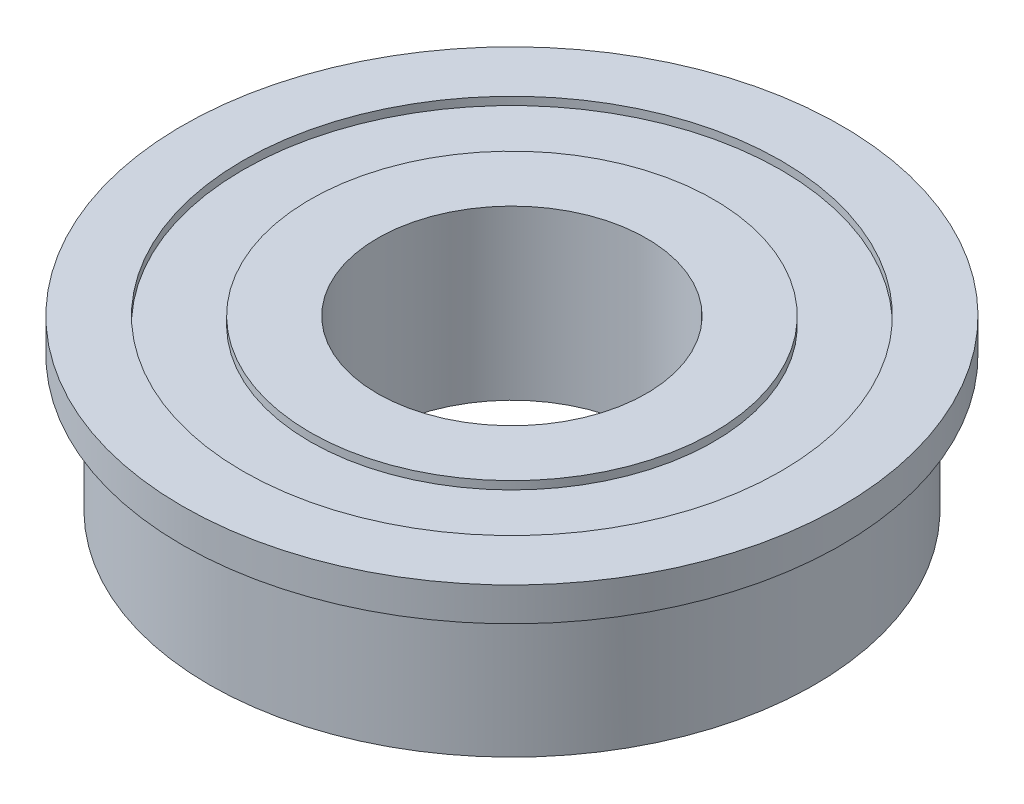
ISO-10303-21;
HEADER;
FILE_DESCRIPTION(('STEP AP214'),'2;1');
FILE_NAME('part.step','',(''),(''),'','','');
FILE_SCHEMA(('AUTOMOTIVE_DESIGN { 1 0 10303 214 1 1 1 1 }'));
ENDSEC;
DATA;
#1=APPLICATION_CONTEXT('core data for automotive mechanical design processes');
#2=APPLICATION_PROTOCOL_DEFINITION('international standard','automotive_design',2000,#1);
#3=PRODUCT_CONTEXT('',#1,'mechanical');
#4=PRODUCT('Part','Part','',(#3));
#5=PRODUCT_RELATED_PRODUCT_CATEGORY('part','',(#4));
#6=PRODUCT_DEFINITION_FORMATION('','',#4);
#7=PRODUCT_DEFINITION_CONTEXT('part definition',#1,'design');
#8=PRODUCT_DEFINITION('design','',#6,#7);
#9=PRODUCT_DEFINITION_SHAPE('','',#8);
#10=(LENGTH_UNIT() NAMED_UNIT(*) SI_UNIT(.MILLI.,.METRE.));
#11=(NAMED_UNIT(*) PLANE_ANGLE_UNIT() SI_UNIT($,.RADIAN.));
#12=(NAMED_UNIT(*) SI_UNIT($,.STERADIAN.) SOLID_ANGLE_UNIT());
#13=UNCERTAINTY_MEASURE_WITH_UNIT(LENGTH_MEASURE(1.E-05),#10,'distance_accuracy_value','');
#14=(GEOMETRIC_REPRESENTATION_CONTEXT(3) GLOBAL_UNCERTAINTY_ASSIGNED_CONTEXT((#13)) GLOBAL_UNIT_ASSIGNED_CONTEXT((#10,
#11,#12)) REPRESENTATION_CONTEXT('',''));
#15=CARTESIAN_POINT('',(0.,0.,0.));
#16=DIRECTION('',(0.,0.,1.));
#17=DIRECTION('',(1.,0.,0.));
#18=AXIS2_PLACEMENT_3D('',#15,#16,#17);
#19=CARTESIAN_POINT('',(12.7,7.9375,0.));
#20=DIRECTION('',(0.,1.,0.));
#21=DIRECTION('',(0.,0.,1.));
#22=AXIS2_PLACEMENT_3D('',#19,#20,#21);
#23=PLANE('',#22);
#24=CARTESIAN_POINT('',(0.,7.9375,0.));
#25=DIRECTION('',(0.,1.,0.));
#26=DIRECTION('',(0.,0.,1.));
#27=AXIS2_PLACEMENT_3D('',#24,#25,#26);
#28=CIRCLE('',#27,12.7);
#29=CARTESIAN_POINT('',(0.,7.9375,12.7));
#30=VERTEX_POINT('',#29);
#31=EDGE_CURVE('E94',#30,#30,#28,.F.);
#32=ORIENTED_EDGE('',*,*,#31,.T.);
#33=EDGE_LOOP('',(#32));
#34=FACE_BOUND('',#33,.T.);
#35=CARTESIAN_POINT('',(0.,7.9375,0.));
#36=DIRECTION('',(0.,1.,0.));
#37=DIRECTION('',(0.,0.,1.));
#38=AXIS2_PLACEMENT_3D('',#35,#36,#37);
#39=CIRCLE('',#38,15.5575);
#40=CARTESIAN_POINT('',(0.,7.9375,15.5575));
#41=VERTEX_POINT('',#40);
#42=EDGE_CURVE('E50',#41,#41,#39,.F.);
#43=ORIENTED_EDGE('',*,*,#42,.F.);
#44=EDGE_LOOP('',(#43));
#45=FACE_BOUND('',#44,.T.);
#46=ADVANCED_FACE('F17',(#34,#45),#23,.T.);
#47=CARTESIAN_POINT('',(0.,0.,0.));
#48=DIRECTION('',(0.,1.,0.));
#49=DIRECTION('',(0.,0.,1.));
#50=AXIS2_PLACEMENT_3D('',#47,#48,#49);
#51=CYLINDRICAL_SURFACE('',#50,15.5575);
#52=CARTESIAN_POINT('',(0.,6.35,0.));
#53=DIRECTION('',(0.,1.,0.));
#54=DIRECTION('',(0.,0.,1.));
#55=AXIS2_PLACEMENT_3D('',#52,#53,#54);
#56=CIRCLE('',#55,15.5575);
#57=CARTESIAN_POINT('',(0.,6.35,15.5575));
#58=VERTEX_POINT('',#57);
#59=EDGE_CURVE('E92',#58,#58,#56,.F.);
#60=ORIENTED_EDGE('',*,*,#59,.F.);
#61=EDGE_LOOP('',(#60));
#62=FACE_BOUND('',#61,.T.);
#63=ORIENTED_EDGE('',*,*,#42,.T.);
#64=EDGE_LOOP('',(#63));
#65=FACE_BOUND('',#64,.T.);
#66=ADVANCED_FACE('F101',(#62,#65),#51,.T.);
#67=CARTESIAN_POINT('',(0.,0.,0.));
#68=DIRECTION('',(0.,1.,0.));
#69=DIRECTION('',(0.,0.,1.));
#70=AXIS2_PLACEMENT_3D('',#67,#68,#69);
#71=CYLINDRICAL_SURFACE('',#70,12.7);
#72=ORIENTED_EDGE('',*,*,#31,.F.);
#73=EDGE_LOOP('',(#72));
#74=FACE_BOUND('',#73,.T.);
#75=CARTESIAN_POINT('',(0.,7.5565,0.));
#76=DIRECTION('',(0.,1.,0.));
#77=DIRECTION('',(0.,0.,1.));
#78=AXIS2_PLACEMENT_3D('',#75,#76,#77);
#79=CIRCLE('',#78,12.7);
#80=CARTESIAN_POINT('',(0.,7.5565,12.7));
#81=VERTEX_POINT('',#80);
#82=EDGE_CURVE('E41',#81,#81,#79,.T.);
#83=ORIENTED_EDGE('',*,*,#82,.F.);
#84=EDGE_LOOP('',(#83));
#85=FACE_BOUND('',#84,.T.);
#86=ADVANCED_FACE('F108',(#74,#85),#71,.F.);
#87=CARTESIAN_POINT('',(15.5575,6.35,0.));
#88=DIRECTION('',(0.,-1.,0.));
#89=DIRECTION('',(0.,0.,-1.));
#90=AXIS2_PLACEMENT_3D('',#87,#88,#89);
#91=PLANE('',#90);
#92=ORIENTED_EDGE('',*,*,#59,.T.);
#93=EDGE_LOOP('',(#92));
#94=FACE_BOUND('',#93,.T.);
#95=CARTESIAN_POINT('',(0.,6.35,0.));
#96=DIRECTION('',(0.,-1.,0.));
#97=DIRECTION('',(0.,0.,-1.));
#98=AXIS2_PLACEMENT_3D('',#95,#96,#97);
#99=CIRCLE('',#98,14.2875);
#100=CARTESIAN_POINT('',(0.,6.35,14.2875));
#101=VERTEX_POINT('',#100);
#102=CARTESIAN_POINT('',(0.,6.35,-14.2875));
#103=VERTEX_POINT('',#102);
#104=EDGE_CURVE('E37',#101,#103,#99,.F.);
#105=ORIENTED_EDGE('',*,*,#104,.T.);
#106=CARTESIAN_POINT('',(0.,6.35,0.));
#107=DIRECTION('',(0.,-1.,0.));
#108=DIRECTION('',(0.,0.,1.));
#109=AXIS2_PLACEMENT_3D('',#106,#107,#108);
#110=CIRCLE('',#109,14.2875);
#111=EDGE_CURVE('E34',#103,#101,#110,.F.);
#112=ORIENTED_EDGE('',*,*,#111,.T.);
#113=EDGE_LOOP('',(#105,#112));
#114=FACE_BOUND('',#113,.T.);
#115=ADVANCED_FACE('F39',(#94,#114),#91,.T.);
#116=CARTESIAN_POINT('',(9.525,7.5565,0.));
#117=DIRECTION('',(0.,1.,0.));
#118=DIRECTION('',(0.,0.,1.));
#119=AXIS2_PLACEMENT_3D('',#116,#117,#118);
#120=PLANE('',#119);
#121=CARTESIAN_POINT('',(0.,7.5565,0.));
#122=DIRECTION('',(0.,1.,0.));
#123=DIRECTION('',(0.,0.,1.));
#124=AXIS2_PLACEMENT_3D('',#121,#122,#123);
#125=CIRCLE('',#124,9.525);
#126=CARTESIAN_POINT('',(0.,7.5565,9.525));
#127=VERTEX_POINT('',#126);
#128=EDGE_CURVE('E47',#127,#127,#125,.T.);
#129=ORIENTED_EDGE('',*,*,#128,.F.);
#130=EDGE_LOOP('',(#129));
#131=FACE_BOUND('',#130,.T.);
#132=ORIENTED_EDGE('',*,*,#82,.T.);
#133=EDGE_LOOP('',(#132));
#134=FACE_BOUND('',#133,.T.);
#135=ADVANCED_FACE('F139',(#131,#134),#120,.T.);
#136=CARTESIAN_POINT('',(0.,0.,0.));
#137=DIRECTION('',(0.,1.,0.));
#138=DIRECTION('',(0.,0.,1.));
#139=AXIS2_PLACEMENT_3D('',#136,#137,#138);
#140=CYLINDRICAL_SURFACE('',#139,9.525);
#141=ORIENTED_EDGE('',*,*,#128,.T.);
#142=EDGE_LOOP('',(#141));
#143=FACE_BOUND('',#142,.T.);
#144=CARTESIAN_POINT('',(0.,7.9375,0.));
#145=DIRECTION('',(0.,1.,0.));
#146=DIRECTION('',(0.,0.,1.));
#147=AXIS2_PLACEMENT_3D('',#144,#145,#146);
#148=CIRCLE('',#147,9.525);
#149=CARTESIAN_POINT('',(0.,7.9375,9.525));
#150=VERTEX_POINT('',#149);
#151=EDGE_CURVE('E74',#150,#150,#148,.T.);
#152=ORIENTED_EDGE('',*,*,#151,.F.);
#153=EDGE_LOOP('',(#152));
#154=FACE_BOUND('',#153,.T.);
#155=ADVANCED_FACE('F64',(#143,#154),#140,.T.);
#156=CARTESIAN_POINT('',(0.,6.1,0.));
#157=DIRECTION('',(0.,1.,0.));
#158=DIRECTION('',(0.,0.,1.));
#159=AXIS2_PLACEMENT_3D('',#156,#157,#158);
#160=TOROIDAL_SURFACE('',#159,14.2875,0.250000000000001);
#161=ORIENTED_EDGE('',*,*,#111,.F.);
#162=ORIENTED_EDGE('',*,*,#104,.F.);
#163=EDGE_LOOP('',(#161,#162));
#164=FACE_BOUND('',#163,.T.);
#165=CARTESIAN_POINT('',(0.,5.975,0.));
#166=DIRECTION('',(0.,-1.,0.));
#167=DIRECTION('',(0.,0.,-1.));
#168=AXIS2_PLACEMENT_3D('',#165,#166,#167);
#169=CIRCLE('',#168,14.0709936490539);
#170=CARTESIAN_POINT('',(0.,5.975,-14.0709936490539));
#171=VERTEX_POINT('',#170);
#172=EDGE_CURVE('E70',#171,#171,#169,.T.);
#173=ORIENTED_EDGE('',*,*,#172,.F.);
#174=EDGE_LOOP('',(#173));
#175=FACE_BOUND('',#174,.T.);
#176=ADVANCED_FACE('F45',(#164,#175),#160,.F.);
#177=CARTESIAN_POINT('',(6.35,7.9375,0.));
#178=DIRECTION('',(0.,1.,0.));
#179=DIRECTION('',(0.,0.,1.));
#180=AXIS2_PLACEMENT_3D('',#177,#178,#179);
#181=PLANE('',#180);
#182=CARTESIAN_POINT('',(0.,7.9375,0.));
#183=DIRECTION('',(0.,1.,0.));
#184=DIRECTION('',(0.,0.,1.));
#185=AXIS2_PLACEMENT_3D('',#182,#183,#184);
#186=CIRCLE('',#185,6.35);
#187=CARTESIAN_POINT('',(0.,7.9375,6.35));
#188=VERTEX_POINT('',#187);
#189=EDGE_CURVE('E73',#188,#188,#186,.F.);
#190=ORIENTED_EDGE('',*,*,#189,.T.);
#191=EDGE_LOOP('',(#190));
#192=FACE_BOUND('',#191,.T.);
#193=ORIENTED_EDGE('',*,*,#151,.T.);
#194=EDGE_LOOP('',(#193));
#195=FACE_BOUND('',#194,.T.);
#196=ADVANCED_FACE('F63',(#192,#195),#181,.T.);
#197=CARTESIAN_POINT('',(0.,5.6,0.));
#198=DIRECTION('',(0.,-1.,0.));
#199=DIRECTION('',(1.,0.,0.));
#200=AXIS2_PLACEMENT_3D('',#197,#198,#199);
#201=CONICAL_SURFACE('',#200,14.2875,0.5235987755983);
#202=ORIENTED_EDGE('',*,*,#172,.T.);
#203=EDGE_LOOP('',(#202));
#204=FACE_BOUND('',#203,.T.);
#205=CARTESIAN_POINT('',(0.,5.6,0.));
#206=DIRECTION('',(0.,1.,0.));
#207=DIRECTION('',(0.,0.,1.));
#208=AXIS2_PLACEMENT_3D('',#205,#206,#207);
#209=CIRCLE('',#208,14.2875);
#210=CARTESIAN_POINT('',(0.,5.6,14.2875));
#211=VERTEX_POINT('',#210);
#212=EDGE_CURVE('E75',#211,#211,#209,.F.);
#213=ORIENTED_EDGE('',*,*,#212,.F.);
#214=EDGE_LOOP('',(#213));
#215=FACE_BOUND('',#214,.T.);
#216=ADVANCED_FACE('F124',(#204,#215),#201,.T.);
#217=CARTESIAN_POINT('',(0.,0.,0.));
#218=DIRECTION('',(0.,1.,0.));
#219=DIRECTION('',(0.,0.,1.));
#220=AXIS2_PLACEMENT_3D('',#217,#218,#219);
#221=CYLINDRICAL_SURFACE('',#220,6.35);
#222=ORIENTED_EDGE('',*,*,#189,.F.);
#223=EDGE_LOOP('',(#222));
#224=FACE_BOUND('',#223,.T.);
#225=CARTESIAN_POINT('',(0.,0.,0.));
#226=DIRECTION('',(0.,1.,0.));
#227=DIRECTION('',(0.,0.,1.));
#228=AXIS2_PLACEMENT_3D('',#225,#226,#227);
#229=CIRCLE('',#228,6.35);
#230=CARTESIAN_POINT('',(0.,0.,6.35));
#231=VERTEX_POINT('',#230);
#232=EDGE_CURVE('E27',#231,#231,#229,.T.);
#233=ORIENTED_EDGE('',*,*,#232,.F.);
#234=EDGE_LOOP('',(#233));
#235=FACE_BOUND('',#234,.T.);
#236=ADVANCED_FACE('F118',(#224,#235),#221,.F.);
#237=CARTESIAN_POINT('',(0.,0.,0.));
#238=DIRECTION('',(0.,1.,0.));
#239=DIRECTION('',(0.,0.,1.));
#240=AXIS2_PLACEMENT_3D('',#237,#238,#239);
#241=CYLINDRICAL_SURFACE('',#240,14.2875);
#242=CARTESIAN_POINT('',(0.,0.,0.));
#243=DIRECTION('',(0.,1.,0.));
#244=DIRECTION('',(0.,0.,1.));
#245=AXIS2_PLACEMENT_3D('',#242,#243,#244);
#246=CIRCLE('',#245,14.2875);
#247=CARTESIAN_POINT('',(0.,0.,14.2875));
#248=VERTEX_POINT('',#247);
#249=EDGE_CURVE('E11',#248,#248,#246,.F.);
#250=ORIENTED_EDGE('',*,*,#249,.F.);
#251=EDGE_LOOP('',(#250));
#252=FACE_BOUND('',#251,.T.);
#253=ORIENTED_EDGE('',*,*,#212,.T.);
#254=EDGE_LOOP('',(#253));
#255=FACE_BOUND('',#254,.T.);
#256=ADVANCED_FACE('F112',(#252,#255),#241,.T.);
#257=CARTESIAN_POINT('',(14.2875,0.,0.));
#258=DIRECTION('',(0.,-1.,0.));
#259=DIRECTION('',(0.,0.,-1.));
#260=AXIS2_PLACEMENT_3D('',#257,#258,#259);
#261=PLANE('',#260);
#262=ORIENTED_EDGE('',*,*,#249,.T.);
#263=EDGE_LOOP('',(#262));
#264=FACE_BOUND('',#263,.T.);
#265=ORIENTED_EDGE('',*,*,#232,.T.);
#266=EDGE_LOOP('',(#265));
#267=FACE_BOUND('',#266,.T.);
#268=ADVANCED_FACE('F110',(#264,#267),#261,.T.);
#269=CLOSED_SHELL('',(#46,#66,#86,#115,#135,#155,#176,#196,#216,#236,#256,#268));
#270=MANIFOLD_SOLID_BREP('B1',#269);
#271=ADVANCED_BREP_SHAPE_REPRESENTATION('',(#18,#270),#14);
#272=SHAPE_DEFINITION_REPRESENTATION(#9,#271);
ENDSEC;
END-ISO-10303-21;
